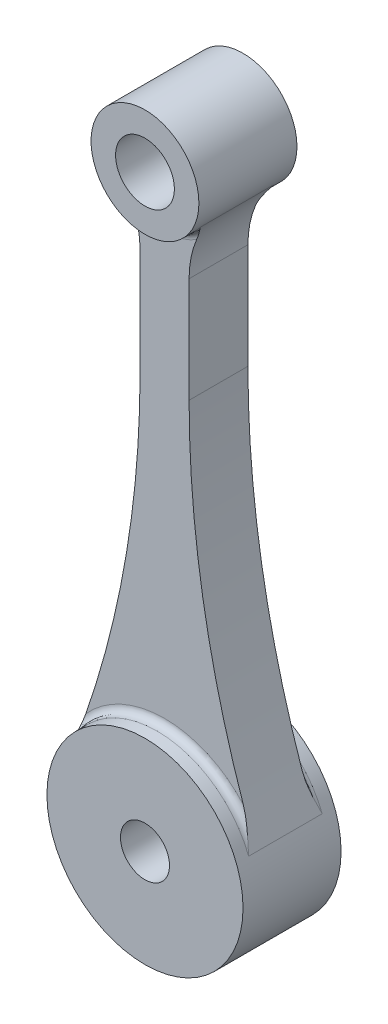
ISO-10303-21;
HEADER;
FILE_DESCRIPTION(('STEP AP214'),'2;1');
FILE_NAME('part.step','',(''),(''),'','','');
FILE_SCHEMA(('AUTOMOTIVE_DESIGN { 1 0 10303 214 1 1 1 1 }'));
ENDSEC;
DATA;
#1=APPLICATION_CONTEXT('core data for automotive mechanical design processes');
#2=APPLICATION_PROTOCOL_DEFINITION('international standard','automotive_design',2000,#1);
#3=PRODUCT_CONTEXT('',#1,'mechanical');
#4=PRODUCT('Part','Part','',(#3));
#5=PRODUCT_RELATED_PRODUCT_CATEGORY('part','',(#4));
#6=PRODUCT_DEFINITION_FORMATION('','',#4);
#7=PRODUCT_DEFINITION_CONTEXT('part definition',#1,'design');
#8=PRODUCT_DEFINITION('design','',#6,#7);
#9=PRODUCT_DEFINITION_SHAPE('','',#8);
#10=(LENGTH_UNIT() NAMED_UNIT(*) SI_UNIT(.MILLI.,.METRE.));
#11=(NAMED_UNIT(*) PLANE_ANGLE_UNIT() SI_UNIT($,.RADIAN.));
#12=(NAMED_UNIT(*) SI_UNIT($,.STERADIAN.) SOLID_ANGLE_UNIT());
#13=UNCERTAINTY_MEASURE_WITH_UNIT(LENGTH_MEASURE(1.E-05),#10,'distance_accuracy_value','');
#14=(GEOMETRIC_REPRESENTATION_CONTEXT(3) GLOBAL_UNCERTAINTY_ASSIGNED_CONTEXT((#13)) GLOBAL_UNIT_ASSIGNED_CONTEXT((#10,
#11,#12)) REPRESENTATION_CONTEXT('',''));
#15=CARTESIAN_POINT('',(0.,0.,0.));
#16=DIRECTION('',(0.,0.,1.));
#17=DIRECTION('',(1.,0.,0.));
#18=AXIS2_PLACEMENT_3D('',#15,#16,#17);
#19=CARTESIAN_POINT('',(0.,0.,10.));
#20=DIRECTION('',(0.,0.,1.));
#21=DIRECTION('',(1.,0.,0.));
#22=AXIS2_PLACEMENT_3D('',#19,#20,#21);
#23=PLANE('',#22);
#24=CARTESIAN_POINT('',(0.,0.,10.));
#25=DIRECTION('',(0.,0.,1.));
#26=DIRECTION('',(1.,0.,0.));
#27=AXIS2_PLACEMENT_3D('',#24,#25,#26);
#28=CIRCLE('',#27,20.);
#29=CARTESIAN_POINT('',(20.,0.,10.));
#30=VERTEX_POINT('',#29);
#31=EDGE_CURVE('E169',#30,#30,#28,.T.);
#32=ORIENTED_EDGE('',*,*,#31,.T.);
#33=EDGE_LOOP('',(#32));
#34=FACE_BOUND('',#33,.T.);
#35=CARTESIAN_POINT('',(0.,0.,10.));
#36=DIRECTION('',(0.,0.,1.));
#37=DIRECTION('',(1.,0.,0.));
#38=AXIS2_PLACEMENT_3D('',#35,#36,#37);
#39=CIRCLE('',#38,5.);
#40=CARTESIAN_POINT('',(5.,0.,10.));
#41=VERTEX_POINT('',#40);
#42=EDGE_CURVE('E159',#41,#41,#39,.T.);
#43=ORIENTED_EDGE('',*,*,#42,.F.);
#44=EDGE_LOOP('',(#43));
#45=FACE_BOUND('',#44,.T.);
#46=ADVANCED_FACE('F33',(#34,#45),#23,.T.);
#47=CARTESIAN_POINT('',(0.,0.,-10.));
#48=DIRECTION('',(0.,0.,1.));
#49=DIRECTION('',(1.,0.,0.));
#50=AXIS2_PLACEMENT_3D('',#47,#48,#49);
#51=PLANE('',#50);
#52=CARTESIAN_POINT('',(0.,0.,-10.));
#53=DIRECTION('',(0.,0.,1.));
#54=DIRECTION('',(1.,0.,0.));
#55=AXIS2_PLACEMENT_3D('',#52,#53,#54);
#56=CIRCLE('',#55,20.);
#57=CARTESIAN_POINT('',(20.,0.,-10.));
#58=VERTEX_POINT('',#57);
#59=EDGE_CURVE('E167',#58,#58,#56,.T.);
#60=ORIENTED_EDGE('',*,*,#59,.F.);
#61=EDGE_LOOP('',(#60));
#62=FACE_BOUND('',#61,.T.);
#63=CARTESIAN_POINT('',(0.,0.,-10.));
#64=DIRECTION('',(0.,0.,1.));
#65=DIRECTION('',(1.,0.,0.));
#66=AXIS2_PLACEMENT_3D('',#63,#64,#65);
#67=CIRCLE('',#66,5.);
#68=CARTESIAN_POINT('',(5.,0.,-10.));
#69=VERTEX_POINT('',#68);
#70=EDGE_CURVE('E155',#69,#69,#67,.T.);
#71=ORIENTED_EDGE('',*,*,#70,.T.);
#72=EDGE_LOOP('',(#71));
#73=FACE_BOUND('',#72,.T.);
#74=ADVANCED_FACE('F269',(#62,#73),#51,.F.);
#75=CARTESIAN_POINT('',(0.,0.,10.));
#76=DIRECTION('',(0.,0.,-1.));
#77=DIRECTION('',(-1.,0.,0.));
#78=AXIS2_PLACEMENT_3D('',#75,#76,#77);
#79=CYLINDRICAL_SURFACE('',#78,20.);
#80=CARTESIAN_POINT('',(0.,0.,-7.5));
#81=DIRECTION('',(0.,0.,1.));
#82=DIRECTION('',(1.,0.,0.));
#83=AXIS2_PLACEMENT_3D('',#80,#81,#82);
#84=CIRCLE('',#83,20.);
#85=CARTESIAN_POINT('',(-18.6481142651053,7.22826634509115,-7.5));
#86=VERTEX_POINT('',#85);
#87=CARTESIAN_POINT('',(18.6481142651053,7.22826634509113,-7.5));
#88=VERTEX_POINT('',#87);
#89=EDGE_CURVE('E177',#86,#88,#84,.F.);
#90=ORIENTED_EDGE('',*,*,#89,.T.);
#91=DIRECTION('',(0.,0.,-1.));
#92=VECTOR('',#91,1.);
#93=CARTESIAN_POINT('',(18.6481142651053,7.22826634509112,6.));
#94=LINE('',#93,#92);
#95=CARTESIAN_POINT('',(18.6481142651053,7.22826634509113,7.5));
#96=VERTEX_POINT('',#95);
#97=EDGE_CURVE('E292',#96,#88,#94,.T.);
#98=ORIENTED_EDGE('',*,*,#97,.F.);
#99=CARTESIAN_POINT('',(0.,0.,7.5));
#100=DIRECTION('',(0.,0.,1.));
#101=DIRECTION('',(1.,0.,0.));
#102=AXIS2_PLACEMENT_3D('',#99,#100,#101);
#103=CIRCLE('',#102,20.);
#104=CARTESIAN_POINT('',(-18.6481142651053,7.22826634509115,7.5));
#105=VERTEX_POINT('',#104);
#106=EDGE_CURVE('E172',#96,#105,#103,.T.);
#107=ORIENTED_EDGE('',*,*,#106,.T.);
#108=DIRECTION('',(0.,0.,-1.));
#109=VECTOR('',#108,1.);
#110=CARTESIAN_POINT('',(-18.6481142651053,7.22826634509115,6.));
#111=LINE('',#110,#109);
#112=EDGE_CURVE('E162',#105,#86,#111,.T.);
#113=ORIENTED_EDGE('',*,*,#112,.T.);
#114=EDGE_LOOP('',(#90,#98,#107,#113));
#115=FACE_BOUND('',#114,.T.);
#116=ORIENTED_EDGE('',*,*,#31,.F.);
#117=EDGE_LOOP('',(#116));
#118=FACE_BOUND('',#117,.T.);
#119=ORIENTED_EDGE('',*,*,#59,.T.);
#120=EDGE_LOOP('',(#119));
#121=FACE_BOUND('',#120,.T.);
#122=ADVANCED_FACE('F274',(#115,#118,#121),#79,.T.);
#123=CARTESIAN_POINT('',(0.,0.,10.));
#124=DIRECTION('',(0.,0.,-1.));
#125=DIRECTION('',(-1.,0.,0.));
#126=AXIS2_PLACEMENT_3D('',#123,#124,#125);
#127=CYLINDRICAL_SURFACE('',#126,5.);
#128=ORIENTED_EDGE('',*,*,#42,.T.);
#129=EDGE_LOOP('',(#128));
#130=FACE_BOUND('',#129,.T.);
#131=ORIENTED_EDGE('',*,*,#70,.F.);
#132=EDGE_LOOP('',(#131));
#133=FACE_BOUND('',#132,.T.);
#134=ADVANCED_FACE('F212',(#130,#133),#127,.F.);
#135=CARTESIAN_POINT('',(206.912246173204,80.2020410288673,6.));
#136=DIRECTION('',(0.,0.,-1.));
#137=DIRECTION('',(-1.,0.,0.));
#138=AXIS2_PLACEMENT_3D('',#135,#136,#137);
#139=CYLINDRICAL_SURFACE('',#138,201.912246173204);
#140=ORIENTED_EDGE('',*,*,#97,.T.);
#141=CARTESIAN_POINT('',(16.0593915870727,14.2949621144325,-6.));
#142=CARTESIAN_POINT('',(16.1006536952669,14.1754753958447,-6.00001602232113));
#143=CARTESIAN_POINT('',(16.1420221672805,14.0560452300212,-6.00236364174549));
#144=CARTESIAN_POINT('',(16.2249250693921,13.8174294281481,-6.01122841546142));
#145=CARTESIAN_POINT('',(16.2664594535409,13.6982437365909,-6.01774448543643));
#146=CARTESIAN_POINT('',(16.3496188353434,13.4603293139278,-6.0344429675061));
#147=CARTESIAN_POINT('',(16.3912436637893,13.3416002055041,-6.04462095780592));
#148=CARTESIAN_POINT('',(16.474614355883,13.104505043297,-6.06824871526269));
#149=CARTESIAN_POINT('',(16.5163602282275,12.9861390169237,-6.08169872356271));
#150=CARTESIAN_POINT('',(16.6413582816509,12.6327683299712,-6.12627700219664));
#151=CARTESIAN_POINT('',(16.7247668152764,12.3983585047765,-6.16172009800773));
#152=CARTESIAN_POINT('',(16.8919587539836,11.9312046260709,-6.24186223068328));
#153=CARTESIAN_POINT('',(16.9757422854823,11.6984612159017,-6.28656466186983));
#154=CARTESIAN_POINT('',(17.1890070534446,11.109407484342,-6.40949821500807));
#155=CARTESIAN_POINT('',(17.3187304550131,10.7542484759841,-6.49279850831655));
#156=CARTESIAN_POINT('',(17.5791415039691,10.0474088872059,-6.67147800946466));
#157=CARTESIAN_POINT('',(17.7098291679302,9.69572836681763,-6.76685742537645));
#158=CARTESIAN_POINT('',(18.1041013686481,8.64365924995585,-7.06469767404981));
#159=CARTESIAN_POINT('',(18.3695278192993,7.9472569079972,-7.27862120688438));
#160=CARTESIAN_POINT('',(18.6418666749908,7.24438596708937,-7.49503656019546));
#161=CARTESIAN_POINT('',(18.6449902140357,7.23632605190587,-7.49751829132909));
#162=CARTESIAN_POINT('',(18.6481142651053,7.22826634509113,-7.5));
#163=B_SPLINE_CURVE_WITH_KNOTS('',3,(#141,#142,#143,#144,#145,#146,#147,#148,#149,#150,#151,
#152,#153,#154,#155,#156,#157,#158,#159,#160,#161,#162),.UNSPECIFIED.,.F.,.F.,(4,2,2,2,2,2,2,2,
2,2,4),(0.,0.379183324241781,0.758268053654196,1.13689656343442,1.51555298605618,
2.26926103822635,3.02324587808531,4.18443837654353,5.34565088015544,7.67138597053297,
7.69836558191353),.UNSPECIFIED.);
#164=CARTESIAN_POINT('',(16.0593915870727,14.2949621144325,-6.));
#165=VERTEX_POINT('',#164);
#166=EDGE_CURVE('E189',#88,#165,#163,.F.);
#167=ORIENTED_EDGE('',*,*,#166,.T.);
#168=CARTESIAN_POINT('',(206.912246173204,80.2020410288673,-6.));
#169=DIRECTION('',(0.,0.,-1.));
#170=DIRECTION('',(1.,0.,0.));
#171=AXIS2_PLACEMENT_3D('',#168,#169,#170);
#172=CIRCLE('',#171,201.912246173204);
#173=CARTESIAN_POINT('',(5.,80.2020410288673,-6.));
#174=VERTEX_POINT('',#173);
#175=EDGE_CURVE('E153',#165,#174,#172,.T.);
#176=ORIENTED_EDGE('',*,*,#175,.T.);
#177=DIRECTION('',(0.,0.,-1.));
#178=VECTOR('',#177,1.);
#179=CARTESIAN_POINT('',(5.,80.2020410288673,6.));
#180=LINE('',#179,#178);
#181=CARTESIAN_POINT('',(5.,80.2020410288673,6.));
#182=VERTEX_POINT('',#181);
#183=EDGE_CURVE('E146',#182,#174,#180,.T.);
#184=ORIENTED_EDGE('',*,*,#183,.F.);
#185=CARTESIAN_POINT('',(206.912246173204,80.2020410288673,6.));
#186=DIRECTION('',(0.,0.,-1.));
#187=DIRECTION('',(1.,0.,0.));
#188=AXIS2_PLACEMENT_3D('',#185,#186,#187);
#189=CIRCLE('',#188,201.912246173204);
#190=CARTESIAN_POINT('',(16.0593915870727,14.2949621144325,6.));
#191=VERTEX_POINT('',#190);
#192=EDGE_CURVE('E129',#191,#182,#189,.T.);
#193=ORIENTED_EDGE('',*,*,#192,.F.);
#194=CARTESIAN_POINT('',(16.0593915870727,14.2949621144325,6.));
#195=CARTESIAN_POINT('',(16.1006536952669,14.1754753958447,6.00001602232113));
#196=CARTESIAN_POINT('',(16.1420221672805,14.0560452300212,6.00236364174548));
#197=CARTESIAN_POINT('',(16.2249250693921,13.8174294281481,6.01122841546142));
#198=CARTESIAN_POINT('',(16.2664594535409,13.6982437365909,6.01774448543643));
#199=CARTESIAN_POINT('',(16.3496188353434,13.4603293139278,6.0344429675061));
#200=CARTESIAN_POINT('',(16.3912436637893,13.3416002055041,6.04462095780592));
#201=CARTESIAN_POINT('',(16.474614355883,13.104505043297,6.06824871526268));
#202=CARTESIAN_POINT('',(16.5163602282275,12.9861390169237,6.08169872356271));
#203=CARTESIAN_POINT('',(16.6413582816509,12.6327683299712,6.12627700219664));
#204=CARTESIAN_POINT('',(16.7247668152764,12.3983585047765,6.16172009800772));
#205=CARTESIAN_POINT('',(16.8919587539836,11.9312046260709,6.24186223068328));
#206=CARTESIAN_POINT('',(16.9757422854823,11.6984612159017,6.28656466186982));
#207=CARTESIAN_POINT('',(17.1890070534446,11.109407484342,6.40949821500807));
#208=CARTESIAN_POINT('',(17.3187304550131,10.7542484759841,6.49279850831655));
#209=CARTESIAN_POINT('',(17.5791415039691,10.0474088872059,6.67147800946466));
#210=CARTESIAN_POINT('',(17.7098291679302,9.69572836681763,6.76685742537644));
#211=CARTESIAN_POINT('',(18.1041013686481,8.64365924995585,7.06469767404981));
#212=CARTESIAN_POINT('',(18.3695278192993,7.9472569079972,7.27862120688437));
#213=CARTESIAN_POINT('',(18.6418666749908,7.24438596708937,7.49503656019546));
#214=CARTESIAN_POINT('',(18.6449902140357,7.23632605190587,7.49751829132909));
#215=CARTESIAN_POINT('',(18.6481142651053,7.22826634509113,7.5));
#216=B_SPLINE_CURVE_WITH_KNOTS('',3,(#194,#195,#196,#197,#198,#199,#200,#201,#202,#203,#204,
#205,#206,#207,#208,#209,#210,#211,#212,#213,#214,#215),.UNSPECIFIED.,.F.,.F.,(4,2,2,2,2,2,2,2,
2,2,4),(0.,0.379183324241781,0.758268053654196,1.13689656343442,1.51555298605618,
2.26926103822635,3.02324587808531,4.18443837654353,5.34565088015544,7.67138597053297,
7.69836558191353),.UNSPECIFIED.);
#217=EDGE_CURVE('E216',#191,#96,#216,.T.);
#218=ORIENTED_EDGE('',*,*,#217,.T.);
#219=EDGE_LOOP('',(#140,#167,#176,#184,#193,#218));
#220=FACE_BOUND('',#219,.T.);
#221=ADVANCED_FACE('F151',(#220),#139,.F.);
#222=CARTESIAN_POINT('',(5.,80.2020410288673,6.));
#223=DIRECTION('',(-1.,0.,0.));
#224=DIRECTION('',(0.,-1.,0.));
#225=AXIS2_PLACEMENT_3D('',#222,#223,#224);
#226=PLANE('',#225);
#227=DIRECTION('',(0.,1.,0.));
#228=VECTOR('',#227,1.);
#229=CARTESIAN_POINT('',(5.,80.2020410288673,-6.));
#230=LINE('',#229,#228);
#231=CARTESIAN_POINT('',(5.,101.669697220177,-6.));
#232=VERTEX_POINT('',#231);
#233=EDGE_CURVE('E301',#174,#232,#230,.T.);
#234=ORIENTED_EDGE('',*,*,#233,.T.);
#235=DIRECTION('',(0.,0.,1.));
#236=VECTOR('',#235,1.);
#237=CARTESIAN_POINT('',(5.,101.669697220177,7.5));
#238=LINE('',#237,#236);
#239=CARTESIAN_POINT('',(5.,101.669697220177,6.));
#240=VERTEX_POINT('',#239);
#241=EDGE_CURVE('E148',#232,#240,#238,.T.);
#242=ORIENTED_EDGE('',*,*,#241,.T.);
#243=DIRECTION('',(0.,1.,0.));
#244=VECTOR('',#243,1.);
#245=CARTESIAN_POINT('',(5.,80.2020410288673,6.));
#246=LINE('',#245,#244);
#247=EDGE_CURVE('E133',#182,#240,#246,.T.);
#248=ORIENTED_EDGE('',*,*,#247,.F.);
#249=ORIENTED_EDGE('',*,*,#183,.T.);
#250=EDGE_LOOP('',(#234,#242,#248,#249));
#251=FACE_BOUND('',#250,.T.);
#252=ADVANCED_FACE('F145',(#251),#226,.F.);
#253=CARTESIAN_POINT('',(-5.,80.2020410288673,6.));
#254=DIRECTION('',(1.,0.,0.));
#255=DIRECTION('',(0.,1.,0.));
#256=AXIS2_PLACEMENT_3D('',#253,#254,#255);
#257=PLANE('',#256);
#258=DIRECTION('',(0.,-1.,0.));
#259=VECTOR('',#258,1.);
#260=CARTESIAN_POINT('',(-5.,80.2020410288673,6.));
#261=LINE('',#260,#259);
#262=CARTESIAN_POINT('',(-5.,101.669697220177,6.));
#263=VERTEX_POINT('',#262);
#264=CARTESIAN_POINT('',(-5.,80.2020410288673,6.));
#265=VERTEX_POINT('',#264);
#266=EDGE_CURVE('E149',#263,#265,#261,.T.);
#267=ORIENTED_EDGE('',*,*,#266,.F.);
#268=DIRECTION('',(0.,0.,1.));
#269=VECTOR('',#268,1.);
#270=CARTESIAN_POINT('',(-5.,101.669697220177,-7.5));
#271=LINE('',#270,#269);
#272=CARTESIAN_POINT('',(-5.,101.669697220177,-6.));
#273=VERTEX_POINT('',#272);
#274=EDGE_CURVE('E363',#263,#273,#271,.F.);
#275=ORIENTED_EDGE('',*,*,#274,.T.);
#276=DIRECTION('',(0.,-1.,0.));
#277=VECTOR('',#276,1.);
#278=CARTESIAN_POINT('',(-5.,80.2020410288673,-6.));
#279=LINE('',#278,#277);
#280=CARTESIAN_POINT('',(-5.,80.2020410288673,-6.));
#281=VERTEX_POINT('',#280);
#282=EDGE_CURVE('E304',#273,#281,#279,.T.);
#283=ORIENTED_EDGE('',*,*,#282,.T.);
#284=DIRECTION('',(0.,0.,-1.));
#285=VECTOR('',#284,1.);
#286=CARTESIAN_POINT('',(-5.,80.2020410288673,6.));
#287=LINE('',#286,#285);
#288=EDGE_CURVE('E156',#265,#281,#287,.T.);
#289=ORIENTED_EDGE('',*,*,#288,.F.);
#290=EDGE_LOOP('',(#267,#275,#283,#289));
#291=FACE_BOUND('',#290,.T.);
#292=ADVANCED_FACE('F353',(#291),#257,.F.);
#293=CARTESIAN_POINT('',(-206.912246173203,80.2020410288673,6.));
#294=DIRECTION('',(0.,0.,-1.));
#295=DIRECTION('',(-1.,0.,0.));
#296=AXIS2_PLACEMENT_3D('',#293,#294,#295);
#297=CYLINDRICAL_SURFACE('',#296,201.912246173203);
#298=CARTESIAN_POINT('',(-206.912246173203,80.2020410288673,-6.));
#299=DIRECTION('',(0.,0.,-1.));
#300=DIRECTION('',(-1.,0.,0.));
#301=AXIS2_PLACEMENT_3D('',#298,#299,#300);
#302=CIRCLE('',#301,201.912246173203);
#303=CARTESIAN_POINT('',(-16.0593915870727,14.2949621144325,-6.));
#304=VERTEX_POINT('',#303);
#305=EDGE_CURVE('E140',#281,#304,#302,.T.);
#306=ORIENTED_EDGE('',*,*,#305,.T.);
#307=CARTESIAN_POINT('',(-16.0593915870726,14.2949621144325,-6.));
#308=CARTESIAN_POINT('',(-16.1006536952667,14.1754753958449,-6.00001602232113));
#309=CARTESIAN_POINT('',(-16.1420221672803,14.0560452300217,-6.00236364174548));
#310=CARTESIAN_POINT('',(-16.2249250693918,13.817429428149,-6.01122841546138));
#311=CARTESIAN_POINT('',(-16.2664594535406,13.698243736592,-6.01774448543637));
#312=CARTESIAN_POINT('',(-16.3496188353429,13.4603293139292,-6.03444296750598));
#313=CARTESIAN_POINT('',(-16.3912436637887,13.3416002055057,-6.04462095780577));
#314=CARTESIAN_POINT('',(-16.4746143558823,13.1045050432989,-6.06824871526248));
#315=CARTESIAN_POINT('',(-16.5163602282268,12.9861390169257,-6.08169872356247));
#316=CARTESIAN_POINT('',(-16.6413582816502,12.6327683299731,-6.12627700219637));
#317=CARTESIAN_POINT('',(-16.7247668152759,12.398358504778,-6.16172009800746));
#318=CARTESIAN_POINT('',(-16.8919587539833,11.9312046260716,-6.24186223068317));
#319=CARTESIAN_POINT('',(-16.9757422854821,11.6984612159021,-6.28656466186985));
#320=CARTESIAN_POINT('',(-17.1890070534446,11.109407484342,-6.40949821500795));
#321=CARTESIAN_POINT('',(-17.3187304550132,10.7542484759839,-6.4927985083159));
#322=CARTESIAN_POINT('',(-17.5791415039691,10.0474088872058,-6.6714780094654));
#323=CARTESIAN_POINT('',(-17.7098291679301,9.6957283668179,-6.7668574253791));
#324=CARTESIAN_POINT('',(-18.1041013686489,8.64365924995416,-7.06469767404465));
#325=CARTESIAN_POINT('',(-18.3695278193027,7.94725690798966,-7.27862120685599));
#326=CARTESIAN_POINT('',(-18.6418666749909,7.2443859670893,-7.49503656019477));
#327=CARTESIAN_POINT('',(-18.6449902140357,7.23632605190584,-7.49751829132874));
#328=CARTESIAN_POINT('',(-18.6481142651053,7.22826634509114,-7.5));
#329=B_SPLINE_CURVE_WITH_KNOTS('',3,(#307,#308,#309,#310,#311,#312,#313,#314,#315,#316,#317,
#318,#319,#320,#321,#322,#323,#324,#325,#326,#327,#328),.UNSPECIFIED.,.F.,.F.,(4,2,2,2,2,2,2,2,
2,2,4),(0.,0.379183324241119,0.758268053652873,1.13689656343258,1.51555298605382,
2.26926103822525,3.02324587808531,4.18443837654369,5.34565088015609,7.67138597053285,
7.69836558191357),.UNSPECIFIED.);
#330=EDGE_CURVE('E197',#304,#86,#329,.T.);
#331=ORIENTED_EDGE('',*,*,#330,.T.);
#332=ORIENTED_EDGE('',*,*,#112,.F.);
#333=CARTESIAN_POINT('',(-16.0593915870726,14.2949621144325,6.));
#334=CARTESIAN_POINT('',(-16.1006536952667,14.1754753958449,6.00001602232113));
#335=CARTESIAN_POINT('',(-16.1420221672803,14.0560452300217,6.00236364174548));
#336=CARTESIAN_POINT('',(-16.2249250693918,13.817429428149,6.01122841546138));
#337=CARTESIAN_POINT('',(-16.2664594535406,13.698243736592,6.01774448543637));
#338=CARTESIAN_POINT('',(-16.3496188353429,13.4603293139292,6.03444296750598));
#339=CARTESIAN_POINT('',(-16.3912436637887,13.3416002055057,6.04462095780577));
#340=CARTESIAN_POINT('',(-16.4746143558823,13.1045050432989,6.06824871526248));
#341=CARTESIAN_POINT('',(-16.5163602282268,12.9861390169257,6.08169872356247));
#342=CARTESIAN_POINT('',(-16.6413582816502,12.6327683299731,6.12627700219637));
#343=CARTESIAN_POINT('',(-16.7247668152759,12.398358504778,6.16172009800746));
#344=CARTESIAN_POINT('',(-16.8919587539833,11.9312046260716,6.24186223068317));
#345=CARTESIAN_POINT('',(-16.9757422854821,11.6984612159021,6.28656466186985));
#346=CARTESIAN_POINT('',(-17.1890070534446,11.109407484342,6.40949821500795));
#347=CARTESIAN_POINT('',(-17.3187304550132,10.7542484759839,6.4927985083159));
#348=CARTESIAN_POINT('',(-17.5791415039691,10.0474088872058,6.6714780094654));
#349=CARTESIAN_POINT('',(-17.7098291679301,9.6957283668179,6.7668574253791));
#350=CARTESIAN_POINT('',(-18.1041013686489,8.64365924995416,7.06469767404465));
#351=CARTESIAN_POINT('',(-18.3695278193027,7.94725690798966,7.27862120685599));
#352=CARTESIAN_POINT('',(-18.6418666749909,7.2443859670893,7.49503656019477));
#353=CARTESIAN_POINT('',(-18.6449902140357,7.23632605190584,7.49751829132874));
#354=CARTESIAN_POINT('',(-18.6481142651053,7.22826634509114,7.5));
#355=B_SPLINE_CURVE_WITH_KNOTS('',3,(#333,#334,#335,#336,#337,#338,#339,#340,#341,#342,#343,
#344,#345,#346,#347,#348,#349,#350,#351,#352,#353,#354),.UNSPECIFIED.,.F.,.F.,(4,2,2,2,2,2,2,2,
2,2,4),(0.,0.379183324241119,0.758268053652873,1.13689656343258,1.51555298605382,
2.26926103822525,3.02324587808531,4.18443837654369,5.34565088015609,7.67138597053285,
7.69836558191357),.UNSPECIFIED.);
#356=CARTESIAN_POINT('',(-16.0593915870727,14.2949621144325,6.));
#357=VERTEX_POINT('',#356);
#358=EDGE_CURVE('E222',#105,#357,#355,.F.);
#359=ORIENTED_EDGE('',*,*,#358,.T.);
#360=CARTESIAN_POINT('',(-206.912246173203,80.2020410288673,6.));
#361=DIRECTION('',(0.,0.,-1.));
#362=DIRECTION('',(-1.,0.,0.));
#363=AXIS2_PLACEMENT_3D('',#360,#361,#362);
#364=CIRCLE('',#363,201.912246173203);
#365=EDGE_CURVE('E310',#265,#357,#364,.T.);
#366=ORIENTED_EDGE('',*,*,#365,.F.);
#367=ORIENTED_EDGE('',*,*,#288,.T.);
#368=EDGE_LOOP('',(#306,#331,#332,#359,#366,#367));
#369=FACE_BOUND('',#368,.T.);
#370=ADVANCED_FACE('F350',(#369),#297,.F.);
#371=CARTESIAN_POINT('',(206.912246173204,80.2020410288673,6.));
#372=DIRECTION('',(0.,0.,1.));
#373=DIRECTION('',(1.,0.,0.));
#374=AXIS2_PLACEMENT_3D('',#371,#372,#373);
#375=PLANE('',#374);
#376=ORIENTED_EDGE('',*,*,#365,.T.);
#377=CARTESIAN_POINT('',(0.,0.,6.));
#378=DIRECTION('',(0.,0.,1.));
#379=DIRECTION('',(1.,0.,0.));
#380=AXIS2_PLACEMENT_3D('',#377,#378,#379);
#381=CIRCLE('',#380,21.5);
#382=EDGE_CURVE('E136',#357,#191,#381,.F.);
#383=ORIENTED_EDGE('',*,*,#382,.T.);
#384=ORIENTED_EDGE('',*,*,#192,.T.);
#385=ORIENTED_EDGE('',*,*,#247,.T.);
#386=CARTESIAN_POINT('',(25.,101.669697220177,6.));
#387=DIRECTION('',(0.,0.,1.));
#388=DIRECTION('',(1.,0.,0.));
#389=AXIS2_PLACEMENT_3D('',#386,#387,#388);
#390=CIRCLE('',#389,20.);
#391=CARTESIAN_POINT('',(6.52976453851341,109.341098786856,6.));
#392=VERTEX_POINT('',#391);
#393=EDGE_CURVE('E47',#240,#392,#390,.F.);
#394=ORIENTED_EDGE('',*,*,#393,.T.);
#395=CARTESIAN_POINT('',(0.,120.,6.));
#396=DIRECTION('',(0.,0.,1.));
#397=DIRECTION('',(1.,0.,0.));
#398=AXIS2_PLACEMENT_3D('',#395,#396,#397);
#399=CIRCLE('',#398,12.5);
#400=CARTESIAN_POINT('',(-6.52976453851341,109.341098786856,6.));
#401=VERTEX_POINT('',#400);
#402=EDGE_CURVE('E53',#392,#401,#399,.F.);
#403=ORIENTED_EDGE('',*,*,#402,.T.);
#404=CARTESIAN_POINT('',(-25.,101.669697220177,6.));
#405=DIRECTION('',(0.,0.,1.));
#406=DIRECTION('',(1.,0.,0.));
#407=AXIS2_PLACEMENT_3D('',#404,#405,#406);
#408=CIRCLE('',#407,20.);
#409=EDGE_CURVE('E248',#401,#263,#408,.F.);
#410=ORIENTED_EDGE('',*,*,#409,.T.);
#411=ORIENTED_EDGE('',*,*,#266,.T.);
#412=EDGE_LOOP('',(#376,#383,#384,#385,#394,#403,#410,#411));
#413=FACE_BOUND('',#412,.T.);
#414=ADVANCED_FACE('F132',(#413),#375,.T.);
#415=CARTESIAN_POINT('',(206.912246173204,80.2020410288673,-6.));
#416=DIRECTION('',(0.,0.,1.));
#417=DIRECTION('',(1.,0.,0.));
#418=AXIS2_PLACEMENT_3D('',#415,#416,#417);
#419=PLANE('',#418);
#420=ORIENTED_EDGE('',*,*,#175,.F.);
#421=CARTESIAN_POINT('',(0.,0.,-6.));
#422=DIRECTION('',(0.,0.,1.));
#423=DIRECTION('',(1.,0.,0.));
#424=AXIS2_PLACEMENT_3D('',#421,#422,#423);
#425=CIRCLE('',#424,21.5);
#426=EDGE_CURVE('E181',#165,#304,#425,.T.);
#427=ORIENTED_EDGE('',*,*,#426,.T.);
#428=ORIENTED_EDGE('',*,*,#305,.F.);
#429=ORIENTED_EDGE('',*,*,#282,.F.);
#430=CARTESIAN_POINT('',(-25.,101.669697220177,-6.));
#431=DIRECTION('',(0.,0.,1.));
#432=DIRECTION('',(1.,0.,0.));
#433=AXIS2_PLACEMENT_3D('',#430,#431,#432);
#434=CIRCLE('',#433,20.);
#435=CARTESIAN_POINT('',(-6.52976453851341,109.341098786856,-6.));
#436=VERTEX_POINT('',#435);
#437=EDGE_CURVE('E367',#273,#436,#434,.T.);
#438=ORIENTED_EDGE('',*,*,#437,.T.);
#439=CARTESIAN_POINT('',(0.,120.,-6.));
#440=DIRECTION('',(0.,0.,1.));
#441=DIRECTION('',(1.,0.,0.));
#442=AXIS2_PLACEMENT_3D('',#439,#440,#441);
#443=CIRCLE('',#442,12.5);
#444=CARTESIAN_POINT('',(6.52976453851341,109.341098786856,-6.));
#445=VERTEX_POINT('',#444);
#446=EDGE_CURVE('E61',#436,#445,#443,.T.);
#447=ORIENTED_EDGE('',*,*,#446,.T.);
#448=CARTESIAN_POINT('',(25.,101.669697220177,-6.));
#449=DIRECTION('',(0.,0.,1.));
#450=DIRECTION('',(1.,0.,0.));
#451=AXIS2_PLACEMENT_3D('',#448,#449,#450);
#452=CIRCLE('',#451,20.);
#453=EDGE_CURVE('E383',#445,#232,#452,.T.);
#454=ORIENTED_EDGE('',*,*,#453,.T.);
#455=ORIENTED_EDGE('',*,*,#233,.F.);
#456=EDGE_LOOP('',(#420,#427,#428,#429,#438,#447,#454,#455));
#457=FACE_BOUND('',#456,.T.);
#458=ADVANCED_FACE('F298',(#457),#419,.F.);
#459=CARTESIAN_POINT('',(0.,120.,10.));
#460=DIRECTION('',(0.,0.,1.));
#461=DIRECTION('',(1.,0.,0.));
#462=AXIS2_PLACEMENT_3D('',#459,#460,#461);
#463=PLANE('',#462);
#464=CARTESIAN_POINT('',(0.,120.,10.));
#465=DIRECTION('',(0.,0.,1.));
#466=DIRECTION('',(1.,0.,0.));
#467=AXIS2_PLACEMENT_3D('',#464,#465,#466);
#468=CIRCLE('',#467,11.);
#469=CARTESIAN_POINT('',(11.,120.,10.));
#470=VERTEX_POINT('',#469);
#471=EDGE_CURVE('E302',#470,#470,#468,.T.);
#472=ORIENTED_EDGE('',*,*,#471,.T.);
#473=EDGE_LOOP('',(#472));
#474=FACE_BOUND('',#473,.T.);
#475=CARTESIAN_POINT('',(0.,120.,10.));
#476=DIRECTION('',(0.,0.,1.));
#477=DIRECTION('',(1.,0.,0.));
#478=AXIS2_PLACEMENT_3D('',#475,#476,#477);
#479=CIRCLE('',#478,6.);
#480=CARTESIAN_POINT('',(6.,120.,10.));
#481=VERTEX_POINT('',#480);
#482=EDGE_CURVE('E320',#481,#481,#479,.T.);
#483=ORIENTED_EDGE('',*,*,#482,.F.);
#484=EDGE_LOOP('',(#483));
#485=FACE_BOUND('',#484,.T.);
#486=ADVANCED_FACE('F331',(#474,#485),#463,.T.);
#487=CARTESIAN_POINT('',(0.,120.,-10.));
#488=DIRECTION('',(0.,0.,1.));
#489=DIRECTION('',(1.,0.,0.));
#490=AXIS2_PLACEMENT_3D('',#487,#488,#489);
#491=PLANE('',#490);
#492=CARTESIAN_POINT('',(0.,120.,-10.));
#493=DIRECTION('',(0.,0.,1.));
#494=DIRECTION('',(1.,0.,0.));
#495=AXIS2_PLACEMENT_3D('',#492,#493,#494);
#496=CIRCLE('',#495,11.);
#497=CARTESIAN_POINT('',(11.,120.,-10.));
#498=VERTEX_POINT('',#497);
#499=EDGE_CURVE('E307',#498,#498,#496,.T.);
#500=ORIENTED_EDGE('',*,*,#499,.F.);
#501=EDGE_LOOP('',(#500));
#502=FACE_BOUND('',#501,.T.);
#503=CARTESIAN_POINT('',(0.,120.,-10.));
#504=DIRECTION('',(0.,0.,1.));
#505=DIRECTION('',(1.,0.,0.));
#506=AXIS2_PLACEMENT_3D('',#503,#504,#505);
#507=CIRCLE('',#506,6.);
#508=CARTESIAN_POINT('',(6.,120.,-10.));
#509=VERTEX_POINT('',#508);
#510=EDGE_CURVE('E322',#509,#509,#507,.T.);
#511=ORIENTED_EDGE('',*,*,#510,.T.);
#512=EDGE_LOOP('',(#511));
#513=FACE_BOUND('',#512,.T.);
#514=ADVANCED_FACE('F333',(#502,#513),#491,.F.);
#515=CARTESIAN_POINT('',(0.,120.,10.));
#516=DIRECTION('',(0.,0.,-1.));
#517=DIRECTION('',(-1.,0.,0.));
#518=AXIS2_PLACEMENT_3D('',#515,#516,#517);
#519=CYLINDRICAL_SURFACE('',#518,11.);
#520=CARTESIAN_POINT('',(0.,120.,-7.5));
#521=DIRECTION('',(0.,0.,1.));
#522=DIRECTION('',(1.,0.,0.));
#523=AXIS2_PLACEMENT_3D('',#520,#521,#522);
#524=CIRCLE('',#523,11.);
#525=CARTESIAN_POINT('',(8.87096774193548,113.495699013611,-7.5));
#526=VERTEX_POINT('',#525);
#527=CARTESIAN_POINT('',(-8.87096774193548,113.495699013611,-7.5));
#528=VERTEX_POINT('',#527);
#529=EDGE_CURVE('E185',#526,#528,#524,.F.);
#530=ORIENTED_EDGE('',*,*,#529,.T.);
#531=DIRECTION('',(0.,0.,-1.));
#532=VECTOR('',#531,1.);
#533=CARTESIAN_POINT('',(-8.87096774193548,113.495699013611,10.));
#534=LINE('',#533,#532);
#535=CARTESIAN_POINT('',(-8.87096774193548,113.495699013611,7.5));
#536=VERTEX_POINT('',#535);
#537=EDGE_CURVE('E370',#528,#536,#534,.F.);
#538=ORIENTED_EDGE('',*,*,#537,.T.);
#539=CARTESIAN_POINT('',(0.,120.,7.5));
#540=DIRECTION('',(0.,0.,1.));
#541=DIRECTION('',(1.,0.,0.));
#542=AXIS2_PLACEMENT_3D('',#539,#540,#541);
#543=CIRCLE('',#542,11.);
#544=CARTESIAN_POINT('',(8.87096774193548,113.495699013611,7.5));
#545=VERTEX_POINT('',#544);
#546=EDGE_CURVE('E187',#536,#545,#543,.T.);
#547=ORIENTED_EDGE('',*,*,#546,.T.);
#548=DIRECTION('',(0.,0.,-1.));
#549=VECTOR('',#548,1.);
#550=CARTESIAN_POINT('',(8.87096774193548,113.495699013611,10.));
#551=LINE('',#550,#549);
#552=EDGE_CURVE('E368',#545,#526,#551,.T.);
#553=ORIENTED_EDGE('',*,*,#552,.T.);
#554=EDGE_LOOP('',(#530,#538,#547,#553));
#555=FACE_BOUND('',#554,.T.);
#556=ORIENTED_EDGE('',*,*,#471,.F.);
#557=EDGE_LOOP('',(#556));
#558=FACE_BOUND('',#557,.T.);
#559=ORIENTED_EDGE('',*,*,#499,.T.);
#560=EDGE_LOOP('',(#559));
#561=FACE_BOUND('',#560,.T.);
#562=ADVANCED_FACE('F340',(#555,#558,#561),#519,.T.);
#563=CARTESIAN_POINT('',(0.,120.,10.));
#564=DIRECTION('',(0.,0.,-1.));
#565=DIRECTION('',(-1.,0.,0.));
#566=AXIS2_PLACEMENT_3D('',#563,#564,#565);
#567=CYLINDRICAL_SURFACE('',#566,6.);
#568=ORIENTED_EDGE('',*,*,#482,.T.);
#569=EDGE_LOOP('',(#568));
#570=FACE_BOUND('',#569,.T.);
#571=ORIENTED_EDGE('',*,*,#510,.F.);
#572=EDGE_LOOP('',(#571));
#573=FACE_BOUND('',#572,.T.);
#574=ADVANCED_FACE('F328',(#570,#573),#567,.F.);
#575=CARTESIAN_POINT('',(0.,0.,-7.5));
#576=DIRECTION('',(0.,0.,1.));
#577=DIRECTION('',(1.,0.,0.));
#578=AXIS2_PLACEMENT_3D('',#575,#576,#577);
#579=TOROIDAL_SURFACE('',#578,21.5,1.5);
#580=ORIENTED_EDGE('',*,*,#330,.F.);
#581=ORIENTED_EDGE('',*,*,#426,.F.);
#582=ORIENTED_EDGE('',*,*,#166,.F.);
#583=ORIENTED_EDGE('',*,*,#89,.F.);
#584=EDGE_LOOP('',(#580,#581,#582,#583));
#585=FACE_BOUND('',#584,.T.);
#586=ADVANCED_FACE('F204',(#585),#579,.F.);
#587=CARTESIAN_POINT('',(0.,0.,7.5));
#588=DIRECTION('',(0.,0.,1.));
#589=DIRECTION('',(1.,0.,0.));
#590=AXIS2_PLACEMENT_3D('',#587,#588,#589);
#591=TOROIDAL_SURFACE('',#590,21.5,1.5);
#592=ORIENTED_EDGE('',*,*,#358,.F.);
#593=ORIENTED_EDGE('',*,*,#106,.F.);
#594=ORIENTED_EDGE('',*,*,#217,.F.);
#595=ORIENTED_EDGE('',*,*,#382,.F.);
#596=EDGE_LOOP('',(#592,#593,#594,#595));
#597=FACE_BOUND('',#596,.T.);
#598=ADVANCED_FACE('F228',(#597),#591,.F.);
#599=CARTESIAN_POINT('',(0.,120.,7.5));
#600=DIRECTION('',(0.,0.,1.));
#601=DIRECTION('',(1.,0.,0.));
#602=AXIS2_PLACEMENT_3D('',#599,#600,#601);
#603=TOROIDAL_SURFACE('',#602,12.5,1.5);
#604=ORIENTED_EDGE('',*,*,#402,.F.);
#605=CARTESIAN_POINT('',(6.52976453851341,109.341098786856,6.));
#606=CARTESIAN_POINT('',(6.56118335819633,109.416747920778,6.00000925177807));
#607=CARTESIAN_POINT('',(6.59305602448827,109.492171876018,6.00231164516609));
#608=CARTESIAN_POINT('',(6.65761775350262,109.642380754178,6.01103347793253));
#609=CARTESIAN_POINT('',(6.69030631753675,109.71716603168,6.0174504589037));
#610=CARTESIAN_POINT('',(6.78931397381605,109.9399612642,6.04212441147701));
#611=CARTESIAN_POINT('',(6.85676792440511,110.086874644215,6.06581023051419));
#612=CARTESIAN_POINT('',(6.99350158938752,110.375515680491,6.12436470006673));
#613=CARTESIAN_POINT('',(7.06275434412564,110.517281815675,6.15911205278858));
#614=CARTESIAN_POINT('',(7.2035844429761,110.797247014588,6.23760984310479));
#615=CARTESIAN_POINT('',(7.27516380163161,110.935442790441,6.28136826800793));
#616=CARTESIAN_POINT('',(7.46301782611866,111.288135152223,6.40371242923498));
#617=CARTESIAN_POINT('',(7.58090625694681,111.499893338873,6.48768150142482));
#618=CARTESIAN_POINT('',(7.82184465737997,111.915117050018,6.66761005920624));
#619=CARTESIAN_POINT('',(7.94489547396964,112.118581202843,6.76357151752113));
#620=CARTESIAN_POINT('',(8.19678616505627,112.519035660713,6.9632781453507));
#621=CARTESIAN_POINT('',(8.32564406752494,112.716001970416,7.0670483357596));
#622=CARTESIAN_POINT('',(8.58921706524392,113.103908169927,7.27819082606446));
#623=CARTESIAN_POINT('',(8.72393100109549,113.294849239829,7.38556241199025));
#624=CARTESIAN_POINT('',(8.86493484363083,113.487467664242,7.49530812204678));
#625=CARTESIAN_POINT('',(8.8679505095689,113.49158391814,7.49765406358552));
#626=CARTESIAN_POINT('',(8.87096774193548,113.495699013611,7.5));
#627=B_SPLINE_CURVE_WITH_KNOTS('',3,(#605,#606,#607,#608,#609,#610,#611,#612,#613,#614,#615,
#616,#617,#618,#619,#620,#621,#622,#623,#624,#625,#626),.UNSPECIFIED.,.F.,.F.,(4,2,2,2,2,2,2,2,
2,2,4),(0.,0.245656008911252,0.49116537846456,0.980682937114108,1.4650074857226,
1.94976319620688,2.71855630954805,3.48747605468144,4.25897409193372,5.03032007474093,
5.04716854660824),.UNSPECIFIED.);
#628=EDGE_CURVE('E11',#392,#545,#627,.T.);
#629=ORIENTED_EDGE('',*,*,#628,.T.);
#630=ORIENTED_EDGE('',*,*,#546,.F.);
#631=CARTESIAN_POINT('',(-6.52976453851341,109.341098786856,6.));
#632=CARTESIAN_POINT('',(-6.56118335819638,109.416747920778,6.00000925177807));
#633=CARTESIAN_POINT('',(-6.59305602448839,109.492171876018,6.0023116451661));
#634=CARTESIAN_POINT('',(-6.65761775350285,109.642380754179,6.01103347793257));
#635=CARTESIAN_POINT('',(-6.69030631753705,109.717166031681,6.01745045890376));
#636=CARTESIAN_POINT('',(-6.78931397381652,109.939961264201,6.04212441147715));
#637=CARTESIAN_POINT('',(-6.85676792440568,110.086874644216,6.0658102305144));
#638=CARTESIAN_POINT('',(-6.9935015893881,110.375515680493,6.12436470006701));
#639=CARTESIAN_POINT('',(-7.06275434412609,110.517281815676,6.15911205278882));
#640=CARTESIAN_POINT('',(-7.20358444297633,110.797247014589,6.23760984310493));
#641=CARTESIAN_POINT('',(-7.27516380163172,110.935442790441,6.28136826800802));
#642=CARTESIAN_POINT('',(-7.46301782611864,111.288135152223,6.40371242923494));
#643=CARTESIAN_POINT('',(-7.5809062569468,111.499893338873,6.48768150142467));
#644=CARTESIAN_POINT('',(-7.82184465737982,111.915117050018,6.66761005920627));
#645=CARTESIAN_POINT('',(-7.94489547396935,112.118581202843,6.76357151752146));
#646=CARTESIAN_POINT('',(-8.19678616505618,112.519035660713,6.96327814535007));
#647=CARTESIAN_POINT('',(-8.32564406752521,112.716001970416,7.06704833575771));
#648=CARTESIAN_POINT('',(-8.58921706524341,113.103908169926,7.27819082606617));
#649=CARTESIAN_POINT('',(-8.72393100109382,113.294849239827,7.38556241199681));
#650=CARTESIAN_POINT('',(-8.8649348436308,113.487467664242,7.4953081220471));
#651=CARTESIAN_POINT('',(-8.86795050956888,113.49158391814,7.49765406358568));
#652=CARTESIAN_POINT('',(-8.87096774193548,113.495699013611,7.5));
#653=B_SPLINE_CURVE_WITH_KNOTS('',3,(#631,#632,#633,#634,#635,#636,#637,#638,#639,#640,#641,
#642,#643,#644,#645,#646,#647,#648,#649,#650,#651,#652),.UNSPECIFIED.,.F.,.F.,(4,2,2,2,2,2,2,2,
2,2,4),(0.,0.245656008911706,0.491165378465475,0.980682937115748,1.46500748572336,
1.94976319620688,2.71855630954793,3.48747605468094,4.25897409193347,5.03032007474106,
5.04716854660824),.UNSPECIFIED.);
#654=EDGE_CURVE('E241',#536,#401,#653,.F.);
#655=ORIENTED_EDGE('',*,*,#654,.T.);
#656=EDGE_LOOP('',(#604,#629,#630,#655));
#657=FACE_BOUND('',#656,.T.);
#658=ADVANCED_FACE('F231',(#657),#603,.F.);
#659=CARTESIAN_POINT('',(0.,120.,-7.5));
#660=DIRECTION('',(0.,0.,1.));
#661=DIRECTION('',(1.,0.,0.));
#662=AXIS2_PLACEMENT_3D('',#659,#660,#661);
#663=TOROIDAL_SURFACE('',#662,12.5,1.5);
#664=ORIENTED_EDGE('',*,*,#529,.F.);
#665=CARTESIAN_POINT('',(6.52976453851341,109.341098786856,-6.));
#666=CARTESIAN_POINT('',(6.56118335819633,109.416747920778,-6.00000925177808));
#667=CARTESIAN_POINT('',(6.59305602448827,109.492171876018,-6.00231164516609));
#668=CARTESIAN_POINT('',(6.65761775350262,109.642380754178,-6.01103347793254));
#669=CARTESIAN_POINT('',(6.69030631753675,109.71716603168,-6.0174504589037));
#670=CARTESIAN_POINT('',(6.78931397381605,109.9399612642,-6.04212441147701));
#671=CARTESIAN_POINT('',(6.85676792440511,110.086874644215,-6.06581023051419));
#672=CARTESIAN_POINT('',(6.99350158938752,110.375515680491,-6.12436470006673));
#673=CARTESIAN_POINT('',(7.06275434412564,110.517281815675,-6.15911205278859));
#674=CARTESIAN_POINT('',(7.20358444297611,110.797247014588,-6.23760984310479));
#675=CARTESIAN_POINT('',(7.27516380163161,110.935442790441,-6.28136826800793));
#676=CARTESIAN_POINT('',(7.46301782611866,111.288135152223,-6.40371242923498));
#677=CARTESIAN_POINT('',(7.58090625694681,111.499893338873,-6.48768150142482));
#678=CARTESIAN_POINT('',(7.82184465737997,111.915117050018,-6.66761005920625));
#679=CARTESIAN_POINT('',(7.94489547396964,112.118581202843,-6.76357151752114));
#680=CARTESIAN_POINT('',(8.19678616505627,112.519035660713,-6.96327814535071));
#681=CARTESIAN_POINT('',(8.32564406752494,112.716001970416,-7.06704833575961));
#682=CARTESIAN_POINT('',(8.58921706524392,113.103908169927,-7.27819082606447));
#683=CARTESIAN_POINT('',(8.72393100109549,113.294849239829,-7.38556241199026));
#684=CARTESIAN_POINT('',(8.86493484363083,113.487467664242,-7.49530812204679));
#685=CARTESIAN_POINT('',(8.8679505095689,113.49158391814,-7.49765406358552));
#686=CARTESIAN_POINT('',(8.87096774193548,113.495699013611,-7.5));
#687=B_SPLINE_CURVE_WITH_KNOTS('',3,(#665,#666,#667,#668,#669,#670,#671,#672,#673,#674,#675,
#676,#677,#678,#679,#680,#681,#682,#683,#684,#685,#686),.UNSPECIFIED.,.F.,.F.,(4,2,2,2,2,2,2,2,
2,2,4),(0.,0.245656008911252,0.49116537846456,0.980682937114108,1.4650074857226,
1.94976319620688,2.71855630954806,3.48747605468144,4.25897409193372,5.03032007474093,
5.04716854660824),.UNSPECIFIED.);
#688=EDGE_CURVE('E382',#526,#445,#687,.F.);
#689=ORIENTED_EDGE('',*,*,#688,.T.);
#690=ORIENTED_EDGE('',*,*,#446,.F.);
#691=CARTESIAN_POINT('',(-6.52976453851341,109.341098786856,-6.));
#692=CARTESIAN_POINT('',(-6.56118335819638,109.416747920778,-6.00000925177808));
#693=CARTESIAN_POINT('',(-6.59305602448839,109.492171876018,-6.0023116451661));
#694=CARTESIAN_POINT('',(-6.65761775350285,109.642380754179,-6.01103347793258));
#695=CARTESIAN_POINT('',(-6.69030631753705,109.717166031681,-6.01745045890377));
#696=CARTESIAN_POINT('',(-6.78931397381652,109.939961264201,-6.04212441147715));
#697=CARTESIAN_POINT('',(-6.85676792440568,110.086874644216,-6.0658102305144));
#698=CARTESIAN_POINT('',(-6.99350158938809,110.375515680493,-6.12436470006701));
#699=CARTESIAN_POINT('',(-7.06275434412609,110.517281815676,-6.15911205278882));
#700=CARTESIAN_POINT('',(-7.20358444297632,110.797247014589,-6.23760984310493));
#701=CARTESIAN_POINT('',(-7.27516380163172,110.935442790441,-6.28136826800802));
#702=CARTESIAN_POINT('',(-7.46301782611865,111.288135152223,-6.40371242923494));
#703=CARTESIAN_POINT('',(-7.5809062569468,111.499893338873,-6.48768150142467));
#704=CARTESIAN_POINT('',(-7.82184465737983,111.915117050018,-6.66761005920629));
#705=CARTESIAN_POINT('',(-7.94489547396936,112.118581202843,-6.76357151752148));
#706=CARTESIAN_POINT('',(-8.1967861650562,112.519035660713,-6.96327814535008));
#707=CARTESIAN_POINT('',(-8.32564406752523,112.716001970416,-7.06704833575772));
#708=CARTESIAN_POINT('',(-8.58921706524341,113.103908169926,-7.27819082606617));
#709=CARTESIAN_POINT('',(-8.72393100109382,113.294849239827,-7.38556241199682));
#710=CARTESIAN_POINT('',(-8.8649348436308,113.487467664242,-7.4953081220471));
#711=CARTESIAN_POINT('',(-8.86795050956888,113.49158391814,-7.49765406358568));
#712=CARTESIAN_POINT('',(-8.87096774193548,113.495699013611,-7.5));
#713=B_SPLINE_CURVE_WITH_KNOTS('',3,(#691,#692,#693,#694,#695,#696,#697,#698,#699,#700,#701,
#702,#703,#704,#705,#706,#707,#708,#709,#710,#711,#712),.UNSPECIFIED.,.F.,.F.,(4,2,2,2,2,2,2,2,
2,2,4),(0.,0.245656008911706,0.491165378465475,0.980682937115748,1.46500748572334,
1.94976319620688,2.71855630954795,3.48747605468098,4.25897409193349,5.03032007474106,
5.04716854660824),.UNSPECIFIED.);
#714=EDGE_CURVE('E249',#436,#528,#713,.T.);
#715=ORIENTED_EDGE('',*,*,#714,.T.);
#716=EDGE_LOOP('',(#664,#689,#690,#715));
#717=FACE_BOUND('',#716,.T.);
#718=ADVANCED_FACE('F237',(#717),#663,.F.);
#719=CARTESIAN_POINT('',(-25.,101.669697220177,10.));
#720=DIRECTION('',(0.,0.,-1.));
#721=DIRECTION('',(-1.,0.,0.));
#722=AXIS2_PLACEMENT_3D('',#719,#720,#721);
#723=CYLINDRICAL_SURFACE('',#722,20.);
#724=ORIENTED_EDGE('',*,*,#654,.F.);
#725=ORIENTED_EDGE('',*,*,#537,.F.);
#726=ORIENTED_EDGE('',*,*,#714,.F.);
#727=ORIENTED_EDGE('',*,*,#437,.F.);
#728=ORIENTED_EDGE('',*,*,#274,.F.);
#729=ORIENTED_EDGE('',*,*,#409,.F.);
#730=EDGE_LOOP('',(#724,#725,#726,#727,#728,#729));
#731=FACE_BOUND('',#730,.T.);
#732=ADVANCED_FACE('F256',(#731),#723,.F.);
#733=CARTESIAN_POINT('',(25.,101.669697220177,10.));
#734=DIRECTION('',(0.,0.,-1.));
#735=DIRECTION('',(-1.,0.,0.));
#736=AXIS2_PLACEMENT_3D('',#733,#734,#735);
#737=CYLINDRICAL_SURFACE('',#736,20.);
#738=ORIENTED_EDGE('',*,*,#393,.F.);
#739=ORIENTED_EDGE('',*,*,#241,.F.);
#740=ORIENTED_EDGE('',*,*,#453,.F.);
#741=ORIENTED_EDGE('',*,*,#688,.F.);
#742=ORIENTED_EDGE('',*,*,#552,.F.);
#743=ORIENTED_EDGE('',*,*,#628,.F.);
#744=EDGE_LOOP('',(#738,#739,#740,#741,#742,#743));
#745=FACE_BOUND('',#744,.T.);
#746=ADVANCED_FACE('F35',(#745),#737,.F.);
#747=CLOSED_SHELL('',(#46,#74,#122,#134,#221,#252,#292,#370,#414,#458,#486,#514,#562,#574,#586,
#598,#658,#718,#732,#746));
#748=MANIFOLD_SOLID_BREP('B2',#747);
#749=ADVANCED_BREP_SHAPE_REPRESENTATION('',(#18,#748),#14);
#750=SHAPE_DEFINITION_REPRESENTATION(#9,#749);
ENDSEC;
END-ISO-10303-21;
